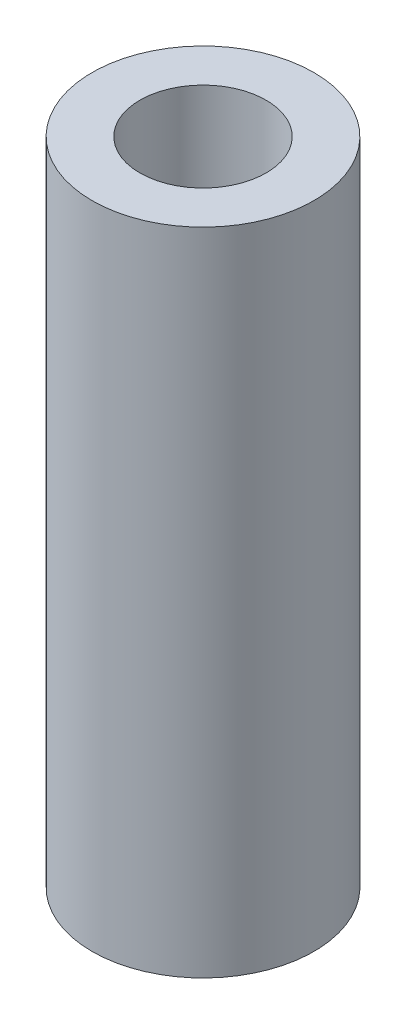
ISO-10303-21;
HEADER;
FILE_DESCRIPTION(('STEP AP214'),'2;1');
FILE_NAME('part.step','',(''),(''),'','','');
FILE_SCHEMA(('AUTOMOTIVE_DESIGN { 1 0 10303 214 1 1 1 1 }'));
ENDSEC;
DATA;
#1=APPLICATION_CONTEXT('core data for automotive mechanical design processes');
#2=APPLICATION_PROTOCOL_DEFINITION('international standard','automotive_design',2000,#1);
#3=PRODUCT_CONTEXT('',#1,'mechanical');
#4=PRODUCT('Part','Part','',(#3));
#5=PRODUCT_RELATED_PRODUCT_CATEGORY('part','',(#4));
#6=PRODUCT_DEFINITION_FORMATION('','',#4);
#7=PRODUCT_DEFINITION_CONTEXT('part definition',#1,'design');
#8=PRODUCT_DEFINITION('design','',#6,#7);
#9=PRODUCT_DEFINITION_SHAPE('','',#8);
#10=(LENGTH_UNIT() NAMED_UNIT(*) SI_UNIT(.MILLI.,.METRE.));
#11=(NAMED_UNIT(*) PLANE_ANGLE_UNIT() SI_UNIT($,.RADIAN.));
#12=(NAMED_UNIT(*) SI_UNIT($,.STERADIAN.) SOLID_ANGLE_UNIT());
#13=UNCERTAINTY_MEASURE_WITH_UNIT(LENGTH_MEASURE(1.E-05),#10,'distance_accuracy_value','');
#14=(GEOMETRIC_REPRESENTATION_CONTEXT(3) GLOBAL_UNCERTAINTY_ASSIGNED_CONTEXT((#13)) GLOBAL_UNIT_ASSIGNED_CONTEXT((#10,
#11,#12)) REPRESENTATION_CONTEXT('',''));
#15=CARTESIAN_POINT('',(0.,0.,0.));
#16=DIRECTION('',(0.,0.,1.));
#17=DIRECTION('',(1.,0.,0.));
#18=AXIS2_PLACEMENT_3D('',#15,#16,#17);
#19=CARTESIAN_POINT('',(0.,58.6082869928158,0.));
#20=DIRECTION('',(0.,-1.,0.));
#21=DIRECTION('',(0.,0.,-1.));
#22=AXIS2_PLACEMENT_3D('',#19,#20,#21);
#23=CYLINDRICAL_SURFACE('',#22,10.);
#24=CARTESIAN_POINT('',(0.,58.6082869928158,0.));
#25=DIRECTION('',(0.,1.,0.));
#26=DIRECTION('',(0.,0.,1.));
#27=AXIS2_PLACEMENT_3D('',#24,#25,#26);
#28=CIRCLE('',#27,10.);
#29=CARTESIAN_POINT('',(0.,58.6082869928158,10.));
#30=VERTEX_POINT('',#29);
#31=EDGE_CURVE('E10',#30,#30,#28,.T.);
#32=ORIENTED_EDGE('',*,*,#31,.F.);
#33=EDGE_LOOP('',(#32));
#34=FACE_BOUND('',#33,.T.);
#35=CARTESIAN_POINT('',(0.,0.,0.));
#36=DIRECTION('',(0.,1.,0.));
#37=DIRECTION('',(0.,0.,1.));
#38=AXIS2_PLACEMENT_3D('',#35,#36,#37);
#39=CIRCLE('',#38,10.);
#40=CARTESIAN_POINT('',(0.,0.,10.));
#41=VERTEX_POINT('',#40);
#42=EDGE_CURVE('E37',#41,#41,#39,.T.);
#43=ORIENTED_EDGE('',*,*,#42,.T.);
#44=EDGE_LOOP('',(#43));
#45=FACE_BOUND('',#44,.T.);
#46=ADVANCED_FACE('F40',(#34,#45),#23,.T.);
#47=CARTESIAN_POINT('',(0.,58.6082869928158,0.));
#48=DIRECTION('',(0.,1.,0.));
#49=DIRECTION('',(0.,0.,1.));
#50=AXIS2_PLACEMENT_3D('',#47,#48,#49);
#51=PLANE('',#50);
#52=CARTESIAN_POINT('',(0.,58.6082869928158,0.));
#53=DIRECTION('',(0.,1.,0.));
#54=DIRECTION('',(0.,0.,1.));
#55=AXIS2_PLACEMENT_3D('',#52,#53,#54);
#56=CIRCLE('',#55,5.68734994534725);
#57=CARTESIAN_POINT('',(0.,58.6082869928158,5.68734994534725));
#58=VERTEX_POINT('',#57);
#59=EDGE_CURVE('E50',#58,#58,#56,.T.);
#60=ORIENTED_EDGE('',*,*,#59,.F.);
#61=EDGE_LOOP('',(#60));
#62=FACE_BOUND('',#61,.T.);
#63=ORIENTED_EDGE('',*,*,#31,.T.);
#64=EDGE_LOOP('',(#63));
#65=FACE_BOUND('',#64,.T.);
#66=ADVANCED_FACE('F59',(#62,#65),#51,.T.);
#67=CARTESIAN_POINT('',(0.,0.,0.));
#68=DIRECTION('',(0.,1.,0.));
#69=DIRECTION('',(0.,0.,1.));
#70=AXIS2_PLACEMENT_3D('',#67,#68,#69);
#71=PLANE('',#70);
#72=CARTESIAN_POINT('',(0.,0.,0.));
#73=DIRECTION('',(0.,1.,0.));
#74=DIRECTION('',(0.,0.,1.));
#75=AXIS2_PLACEMENT_3D('',#72,#73,#74);
#76=CIRCLE('',#75,5.68734994534725);
#77=CARTESIAN_POINT('',(0.,0.,5.68734994534725));
#78=VERTEX_POINT('',#77);
#79=EDGE_CURVE('E47',#78,#78,#76,.T.);
#80=ORIENTED_EDGE('',*,*,#79,.T.);
#81=EDGE_LOOP('',(#80));
#82=FACE_BOUND('',#81,.T.);
#83=ORIENTED_EDGE('',*,*,#42,.F.);
#84=EDGE_LOOP('',(#83));
#85=FACE_BOUND('',#84,.T.);
#86=ADVANCED_FACE('F58',(#82,#85),#71,.F.);
#87=CARTESIAN_POINT('',(0.,58.6082869928158,0.));
#88=DIRECTION('',(0.,-1.,0.));
#89=DIRECTION('',(0.,0.,-1.));
#90=AXIS2_PLACEMENT_3D('',#87,#88,#89);
#91=CYLINDRICAL_SURFACE('',#90,5.68734994534725);
#92=ORIENTED_EDGE('',*,*,#59,.T.);
#93=EDGE_LOOP('',(#92));
#94=FACE_BOUND('',#93,.T.);
#95=ORIENTED_EDGE('',*,*,#79,.F.);
#96=EDGE_LOOP('',(#95));
#97=FACE_BOUND('',#96,.T.);
#98=ADVANCED_FACE('F54',(#94,#97),#91,.F.);
#99=CLOSED_SHELL('',(#46,#66,#86,#98));
#100=MANIFOLD_SOLID_BREP('B2',#99);
#101=ADVANCED_BREP_SHAPE_REPRESENTATION('',(#18,#100),#14);
#102=SHAPE_DEFINITION_REPRESENTATION(#9,#101);
ENDSEC;
END-ISO-10303-21;
